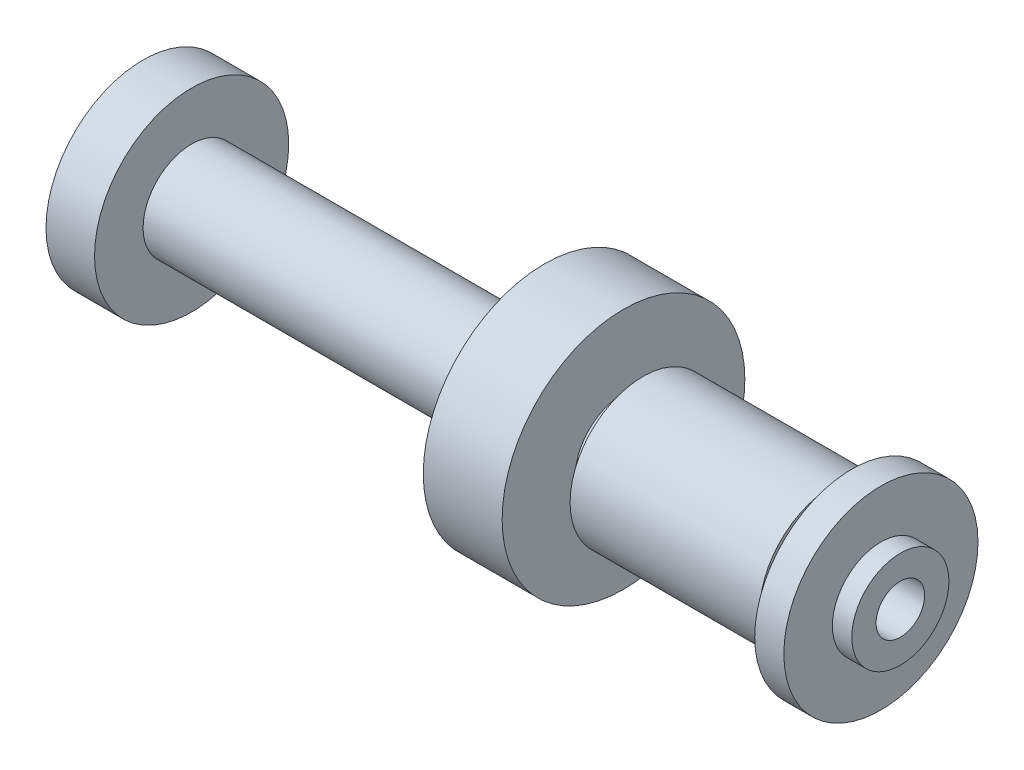
ISO-10303-21;
HEADER;
FILE_DESCRIPTION(('STEP AP214'),'2;1');
FILE_NAME('part.step','',(''),(''),'','','');
FILE_SCHEMA(('AUTOMOTIVE_DESIGN { 1 0 10303 214 1 1 1 1 }'));
ENDSEC;
DATA;
#1=APPLICATION_CONTEXT('core data for automotive mechanical design processes');
#2=APPLICATION_PROTOCOL_DEFINITION('international standard','automotive_design',2000,#1);
#3=PRODUCT_CONTEXT('',#1,'mechanical');
#4=PRODUCT('Part','Part','',(#3));
#5=PRODUCT_RELATED_PRODUCT_CATEGORY('part','',(#4));
#6=PRODUCT_DEFINITION_FORMATION('','',#4);
#7=PRODUCT_DEFINITION_CONTEXT('part definition',#1,'design');
#8=PRODUCT_DEFINITION('design','',#6,#7);
#9=PRODUCT_DEFINITION_SHAPE('','',#8);
#10=(LENGTH_UNIT() NAMED_UNIT(*) SI_UNIT(.MILLI.,.METRE.));
#11=(NAMED_UNIT(*) PLANE_ANGLE_UNIT() SI_UNIT($,.RADIAN.));
#12=(NAMED_UNIT(*) SI_UNIT($,.STERADIAN.) SOLID_ANGLE_UNIT());
#13=UNCERTAINTY_MEASURE_WITH_UNIT(LENGTH_MEASURE(1.E-05),#10,'distance_accuracy_value','');
#14=(GEOMETRIC_REPRESENTATION_CONTEXT(3) GLOBAL_UNCERTAINTY_ASSIGNED_CONTEXT((#13)) GLOBAL_UNIT_ASSIGNED_CONTEXT((#10,
#11,#12)) REPRESENTATION_CONTEXT('',''));
#15=CARTESIAN_POINT('',(0.,0.,0.));
#16=DIRECTION('',(0.,0.,1.));
#17=DIRECTION('',(1.,0.,0.));
#18=AXIS2_PLACEMENT_3D('',#15,#16,#17);
#19=CARTESIAN_POINT('',(0.,0.,0.));
#20=DIRECTION('',(-1.,0.,0.));
#21=DIRECTION('',(0.,0.,1.));
#22=AXIS2_PLACEMENT_3D('',#19,#20,#21);
#23=PLANE('',#22);
#24=CARTESIAN_POINT('',(0.,0.,0.));
#25=DIRECTION('',(1.,0.,0.));
#26=DIRECTION('',(0.,0.,-1.));
#27=AXIS2_PLACEMENT_3D('',#24,#25,#26);
#28=CIRCLE('',#27,3.175);
#29=CARTESIAN_POINT('',(0.,0.,-3.17500000000001));
#30=VERTEX_POINT('',#29);
#31=EDGE_CURVE('E122',#30,#30,#28,.T.);
#32=ORIENTED_EDGE('',*,*,#31,.F.);
#33=EDGE_LOOP('',(#32));
#34=FACE_BOUND('',#33,.T.);
#35=CARTESIAN_POINT('',(0.,0.,0.));
#36=DIRECTION('',(-1.,0.,0.));
#37=DIRECTION('',(0.,0.,1.));
#38=AXIS2_PLACEMENT_3D('',#35,#36,#37);
#39=CIRCLE('',#38,6.35);
#40=CARTESIAN_POINT('',(0.,0.,6.35000000000003));
#41=VERTEX_POINT('',#40);
#42=EDGE_CURVE('E10',#41,#41,#39,.T.);
#43=ORIENTED_EDGE('',*,*,#42,.F.);
#44=EDGE_LOOP('',(#43));
#45=FACE_BOUND('',#44,.T.);
#46=ADVANCED_FACE('F40',(#34,#45),#23,.F.);
#47=CARTESIAN_POINT('',(0.,0.,0.));
#48=DIRECTION('',(-1.,0.,0.));
#49=DIRECTION('',(0.,0.,1.));
#50=AXIS2_PLACEMENT_3D('',#47,#48,#49);
#51=CYLINDRICAL_SURFACE('',#50,6.35);
#52=CARTESIAN_POINT('',(-2.53999999999999,0.,0.));
#53=DIRECTION('',(-1.,0.,0.));
#54=DIRECTION('',(0.,0.,1.));
#55=AXIS2_PLACEMENT_3D('',#52,#53,#54);
#56=CIRCLE('',#55,6.35);
#57=CARTESIAN_POINT('',(-2.53999999999999,0.,6.35000000000003));
#58=VERTEX_POINT('',#57);
#59=EDGE_CURVE('E47',#58,#58,#56,.T.);
#60=ORIENTED_EDGE('',*,*,#59,.F.);
#61=EDGE_LOOP('',(#60));
#62=FACE_BOUND('',#61,.T.);
#63=ORIENTED_EDGE('',*,*,#42,.T.);
#64=EDGE_LOOP('',(#63));
#65=FACE_BOUND('',#64,.T.);
#66=ADVANCED_FACE('F142',(#62,#65),#51,.T.);
#67=CARTESIAN_POINT('',(-2.53999999999999,6.35000000000008,0.));
#68=DIRECTION('',(-1.,0.,0.));
#69=DIRECTION('',(0.,0.,1.));
#70=AXIS2_PLACEMENT_3D('',#67,#68,#69);
#71=PLANE('',#70);
#72=CARTESIAN_POINT('',(-2.53999999999999,0.,0.));
#73=DIRECTION('',(-1.,0.,0.));
#74=DIRECTION('',(0.,0.,1.));
#75=AXIS2_PLACEMENT_3D('',#72,#73,#74);
#76=CIRCLE('',#75,12.7);
#77=CARTESIAN_POINT('',(-2.53999999999999,0.,12.7000000000001));
#78=VERTEX_POINT('',#77);
#79=EDGE_CURVE('E53',#78,#78,#76,.T.);
#80=ORIENTED_EDGE('',*,*,#79,.F.);
#81=EDGE_LOOP('',(#80));
#82=FACE_BOUND('',#81,.T.);
#83=ORIENTED_EDGE('',*,*,#59,.T.);
#84=EDGE_LOOP('',(#83));
#85=FACE_BOUND('',#84,.T.);
#86=ADVANCED_FACE('F146',(#82,#85),#71,.F.);
#87=CARTESIAN_POINT('',(0.,0.,0.));
#88=DIRECTION('',(-1.,0.,0.));
#89=DIRECTION('',(0.,0.,1.));
#90=AXIS2_PLACEMENT_3D('',#87,#88,#89);
#91=CYLINDRICAL_SURFACE('',#90,12.7);
#92=CARTESIAN_POINT('',(-6.34999999999997,0.,0.));
#93=DIRECTION('',(-1.,0.,0.));
#94=DIRECTION('',(0.,0.,1.));
#95=AXIS2_PLACEMENT_3D('',#92,#93,#94);
#96=CIRCLE('',#95,12.7);
#97=CARTESIAN_POINT('',(-6.34999999999997,0.,12.7000000000001));
#98=VERTEX_POINT('',#97);
#99=EDGE_CURVE('E59',#98,#98,#96,.T.);
#100=ORIENTED_EDGE('',*,*,#99,.F.);
#101=EDGE_LOOP('',(#100));
#102=FACE_BOUND('',#101,.T.);
#103=ORIENTED_EDGE('',*,*,#79,.T.);
#104=EDGE_LOOP('',(#103));
#105=FACE_BOUND('',#104,.T.);
#106=ADVANCED_FACE('F151',(#102,#105),#91,.T.);
#107=CARTESIAN_POINT('',(-6.34999999999997,12.7000000000002,-5.41233724504764E-13));
#108=DIRECTION('',(1.,0.,0.));
#109=DIRECTION('',(0.,0.,-1.));
#110=AXIS2_PLACEMENT_3D('',#107,#108,#109);
#111=PLANE('',#110);
#112=CARTESIAN_POINT('',(-6.34999999999997,0.,0.));
#113=DIRECTION('',(-1.,0.,0.));
#114=DIRECTION('',(0.,0.,1.));
#115=AXIS2_PLACEMENT_3D('',#112,#113,#114);
#116=CIRCLE('',#115,6.35);
#117=CARTESIAN_POINT('',(-6.34999999999997,0.,6.35000000000003));
#118=VERTEX_POINT('',#117);
#119=EDGE_CURVE('E65',#118,#118,#116,.T.);
#120=ORIENTED_EDGE('',*,*,#119,.F.);
#121=EDGE_LOOP('',(#120));
#122=FACE_BOUND('',#121,.T.);
#123=ORIENTED_EDGE('',*,*,#99,.T.);
#124=EDGE_LOOP('',(#123));
#125=FACE_BOUND('',#124,.T.);
#126=ADVANCED_FACE('F157',(#122,#125),#111,.F.);
#127=CARTESIAN_POINT('',(0.,0.,0.));
#128=DIRECTION('',(-1.,0.,0.));
#129=DIRECTION('',(0.,0.,1.));
#130=AXIS2_PLACEMENT_3D('',#127,#128,#129);
#131=CYLINDRICAL_SURFACE('',#130,6.35);
#132=CARTESIAN_POINT('',(-8.88999999999995,0.,0.));
#133=DIRECTION('',(-1.,0.,0.));
#134=DIRECTION('',(0.,0.,1.));
#135=AXIS2_PLACEMENT_3D('',#132,#133,#134);
#136=CIRCLE('',#135,6.35);
#137=CARTESIAN_POINT('',(-8.88999999999995,0.,6.35000000000003));
#138=VERTEX_POINT('',#137);
#139=EDGE_CURVE('E69',#138,#138,#136,.T.);
#140=ORIENTED_EDGE('',*,*,#139,.F.);
#141=EDGE_LOOP('',(#140));
#142=FACE_BOUND('',#141,.T.);
#143=ORIENTED_EDGE('',*,*,#119,.T.);
#144=EDGE_LOOP('',(#143));
#145=FACE_BOUND('',#144,.T.);
#146=ADVANCED_FACE('F161',(#142,#145),#131,.T.);
#147=CARTESIAN_POINT('',(-8.88999999999995,6.35000000000008,0.));
#148=DIRECTION('',(-1.,0.,0.));
#149=DIRECTION('',(0.,0.,1.));
#150=AXIS2_PLACEMENT_3D('',#147,#148,#149);
#151=PLANE('',#150);
#152=CARTESIAN_POINT('',(-8.88999999999995,0.,0.));
#153=DIRECTION('',(-1.,0.,0.));
#154=DIRECTION('',(0.,0.,1.));
#155=AXIS2_PLACEMENT_3D('',#152,#153,#154);
#156=CIRCLE('',#155,9.525);
#157=CARTESIAN_POINT('',(-8.88999999999995,0.,9.52500000000004));
#158=VERTEX_POINT('',#157);
#159=EDGE_CURVE('E73',#158,#158,#156,.T.);
#160=ORIENTED_EDGE('',*,*,#159,.F.);
#161=EDGE_LOOP('',(#160));
#162=FACE_BOUND('',#161,.T.);
#163=ORIENTED_EDGE('',*,*,#139,.T.);
#164=EDGE_LOOP('',(#163));
#165=FACE_BOUND('',#164,.T.);
#166=ADVANCED_FACE('F165',(#162,#165),#151,.F.);
#167=CARTESIAN_POINT('',(0.,0.,0.));
#168=DIRECTION('',(-1.,0.,0.));
#169=DIRECTION('',(0.,0.,1.));
#170=AXIS2_PLACEMENT_3D('',#167,#168,#169);
#171=CYLINDRICAL_SURFACE('',#170,9.525);
#172=CARTESIAN_POINT('',(-33.6748863898266,0.,0.));
#173=DIRECTION('',(-1.,0.,0.));
#174=DIRECTION('',(0.,0.,1.));
#175=AXIS2_PLACEMENT_3D('',#172,#173,#174);
#176=CIRCLE('',#175,9.525);
#177=CARTESIAN_POINT('',(-33.6748863898266,0.,9.52500000000005));
#178=VERTEX_POINT('',#177);
#179=EDGE_CURVE('E77',#178,#178,#176,.T.);
#180=ORIENTED_EDGE('',*,*,#179,.F.);
#181=EDGE_LOOP('',(#180));
#182=FACE_BOUND('',#181,.T.);
#183=ORIENTED_EDGE('',*,*,#159,.T.);
#184=EDGE_LOOP('',(#183));
#185=FACE_BOUND('',#184,.T.);
#186=ADVANCED_FACE('F169',(#182,#185),#171,.T.);
#187=CARTESIAN_POINT('',(-33.6748863898266,9.52500000000012,-3.2612801348364E-13));
#188=DIRECTION('',(1.,0.,0.));
#189=DIRECTION('',(0.,0.,-1.));
#190=AXIS2_PLACEMENT_3D('',#187,#188,#189);
#191=PLANE('',#190);
#192=CARTESIAN_POINT('',(-33.6748863898266,0.,0.));
#193=DIRECTION('',(-1.,0.,0.));
#194=DIRECTION('',(0.,0.,1.));
#195=AXIS2_PLACEMENT_3D('',#192,#193,#194);
#196=CIRCLE('',#195,6.35);
#197=CARTESIAN_POINT('',(-33.6748863898266,0.,6.35000000000003));
#198=VERTEX_POINT('',#197);
#199=EDGE_CURVE('E81',#198,#198,#196,.T.);
#200=ORIENTED_EDGE('',*,*,#199,.F.);
#201=EDGE_LOOP('',(#200));
#202=FACE_BOUND('',#201,.T.);
#203=ORIENTED_EDGE('',*,*,#179,.T.);
#204=EDGE_LOOP('',(#203));
#205=FACE_BOUND('',#204,.T.);
#206=ADVANCED_FACE('F173',(#202,#205),#191,.F.);
#207=CARTESIAN_POINT('',(0.,0.,0.));
#208=DIRECTION('',(-1.,0.,0.));
#209=DIRECTION('',(0.,0.,1.));
#210=AXIS2_PLACEMENT_3D('',#207,#208,#209);
#211=CYLINDRICAL_SURFACE('',#210,6.35);
#212=CARTESIAN_POINT('',(-36.2148863898267,0.,0.));
#213=DIRECTION('',(-1.,0.,0.));
#214=DIRECTION('',(0.,0.,1.));
#215=AXIS2_PLACEMENT_3D('',#212,#213,#214);
#216=CIRCLE('',#215,6.35);
#217=CARTESIAN_POINT('',(-36.2148863898267,0.,6.35000000000003));
#218=VERTEX_POINT('',#217);
#219=EDGE_CURVE('E85',#218,#218,#216,.T.);
#220=ORIENTED_EDGE('',*,*,#219,.F.);
#221=EDGE_LOOP('',(#220));
#222=FACE_BOUND('',#221,.T.);
#223=ORIENTED_EDGE('',*,*,#199,.T.);
#224=EDGE_LOOP('',(#223));
#225=FACE_BOUND('',#224,.T.);
#226=ADVANCED_FACE('F177',(#222,#225),#211,.T.);
#227=CARTESIAN_POINT('',(-36.2148863898267,6.35000000000008,0.));
#228=DIRECTION('',(-1.,0.,0.));
#229=DIRECTION('',(0.,0.,1.));
#230=AXIS2_PLACEMENT_3D('',#227,#228,#229);
#231=PLANE('',#230);
#232=CARTESIAN_POINT('',(-36.2148863898267,0.,0.));
#233=DIRECTION('',(-1.,0.,0.));
#234=DIRECTION('',(0.,0.,1.));
#235=AXIS2_PLACEMENT_3D('',#232,#233,#234);
#236=CIRCLE('',#235,15.875);
#237=CARTESIAN_POINT('',(-36.2148863898267,0.,15.8750000000001));
#238=VERTEX_POINT('',#237);
#239=EDGE_CURVE('E89',#238,#238,#236,.T.);
#240=ORIENTED_EDGE('',*,*,#239,.F.);
#241=EDGE_LOOP('',(#240));
#242=FACE_BOUND('',#241,.T.);
#243=ORIENTED_EDGE('',*,*,#219,.T.);
#244=EDGE_LOOP('',(#243));
#245=FACE_BOUND('',#244,.T.);
#246=ADVANCED_FACE('F181',(#242,#245),#231,.F.);
#247=CARTESIAN_POINT('',(0.,0.,0.));
#248=DIRECTION('',(-1.,0.,0.));
#249=DIRECTION('',(0.,0.,1.));
#250=AXIS2_PLACEMENT_3D('',#247,#248,#249);
#251=CYLINDRICAL_SURFACE('',#250,15.875);
#252=CARTESIAN_POINT('',(-46.5313784466667,0.,0.));
#253=DIRECTION('',(-1.,0.,0.));
#254=DIRECTION('',(0.,0.,1.));
#255=AXIS2_PLACEMENT_3D('',#252,#253,#254);
#256=CIRCLE('',#255,15.875);
#257=CARTESIAN_POINT('',(-46.5313784466667,0.,15.8750000000001));
#258=VERTEX_POINT('',#257);
#259=EDGE_CURVE('E93',#258,#258,#256,.T.);
#260=ORIENTED_EDGE('',*,*,#259,.F.);
#261=EDGE_LOOP('',(#260));
#262=FACE_BOUND('',#261,.T.);
#263=ORIENTED_EDGE('',*,*,#239,.T.);
#264=EDGE_LOOP('',(#263));
#265=FACE_BOUND('',#264,.T.);
#266=ADVANCED_FACE('F185',(#262,#265),#251,.T.);
#267=CARTESIAN_POINT('',(-46.5313784466667,15.8750000000002,-3.33066907387547E-13));
#268=DIRECTION('',(1.,0.,0.));
#269=DIRECTION('',(0.,0.,-1.));
#270=AXIS2_PLACEMENT_3D('',#267,#268,#269);
#271=PLANE('',#270);
#272=CARTESIAN_POINT('',(-46.5313784466667,0.,0.));
#273=DIRECTION('',(-1.,0.,0.));
#274=DIRECTION('',(0.,0.,1.));
#275=AXIS2_PLACEMENT_3D('',#272,#273,#274);
#276=CIRCLE('',#275,6.34999999999999);
#277=CARTESIAN_POINT('',(-46.5313784466667,0.,6.35000000000002));
#278=VERTEX_POINT('',#277);
#279=EDGE_CURVE('E97',#278,#278,#276,.T.);
#280=ORIENTED_EDGE('',*,*,#279,.F.);
#281=EDGE_LOOP('',(#280));
#282=FACE_BOUND('',#281,.T.);
#283=ORIENTED_EDGE('',*,*,#259,.T.);
#284=EDGE_LOOP('',(#283));
#285=FACE_BOUND('',#284,.T.);
#286=ADVANCED_FACE('F189',(#282,#285),#271,.F.);
#287=CARTESIAN_POINT('',(0.,0.,0.));
#288=DIRECTION('',(-1.,0.,0.));
#289=DIRECTION('',(0.,0.,1.));
#290=AXIS2_PLACEMENT_3D('',#287,#288,#289);
#291=CYLINDRICAL_SURFACE('',#290,6.34999999999999);
#292=CARTESIAN_POINT('',(-92.71,0.,0.));
#293=DIRECTION('',(-1.,0.,0.));
#294=DIRECTION('',(0.,0.,1.));
#295=AXIS2_PLACEMENT_3D('',#292,#293,#294);
#296=CIRCLE('',#295,6.34999999999999);
#297=CARTESIAN_POINT('',(-92.71,0.,6.35000000000002));
#298=VERTEX_POINT('',#297);
#299=EDGE_CURVE('E101',#298,#298,#296,.T.);
#300=ORIENTED_EDGE('',*,*,#299,.F.);
#301=EDGE_LOOP('',(#300));
#302=FACE_BOUND('',#301,.T.);
#303=ORIENTED_EDGE('',*,*,#279,.T.);
#304=EDGE_LOOP('',(#303));
#305=FACE_BOUND('',#304,.T.);
#306=ADVANCED_FACE('F193',(#302,#305),#291,.T.);
#307=CARTESIAN_POINT('',(-92.71,6.35000000000008,0.));
#308=DIRECTION('',(-1.,0.,0.));
#309=DIRECTION('',(0.,0.,1.));
#310=AXIS2_PLACEMENT_3D('',#307,#308,#309);
#311=PLANE('',#310);
#312=CARTESIAN_POINT('',(-92.71,0.,0.));
#313=DIRECTION('',(-1.,0.,0.));
#314=DIRECTION('',(0.,0.,1.));
#315=AXIS2_PLACEMENT_3D('',#312,#313,#314);
#316=CIRCLE('',#315,12.7);
#317=CARTESIAN_POINT('',(-92.71,0.,12.7));
#318=VERTEX_POINT('',#317);
#319=EDGE_CURVE('E105',#318,#318,#316,.T.);
#320=ORIENTED_EDGE('',*,*,#319,.F.);
#321=EDGE_LOOP('',(#320));
#322=FACE_BOUND('',#321,.T.);
#323=ORIENTED_EDGE('',*,*,#299,.T.);
#324=EDGE_LOOP('',(#323));
#325=FACE_BOUND('',#324,.T.);
#326=ADVANCED_FACE('F197',(#322,#325),#311,.F.);
#327=CARTESIAN_POINT('',(0.,0.,0.));
#328=DIRECTION('',(-1.,0.,0.));
#329=DIRECTION('',(0.,0.,1.));
#330=AXIS2_PLACEMENT_3D('',#327,#328,#329);
#331=CYLINDRICAL_SURFACE('',#330,12.7);
#332=CARTESIAN_POINT('',(-99.06,0.,0.));
#333=DIRECTION('',(-1.,0.,0.));
#334=DIRECTION('',(0.,0.,1.));
#335=AXIS2_PLACEMENT_3D('',#332,#333,#334);
#336=CIRCLE('',#335,12.7);
#337=CARTESIAN_POINT('',(-99.06,0.,12.7));
#338=VERTEX_POINT('',#337);
#339=EDGE_CURVE('E109',#338,#338,#336,.T.);
#340=ORIENTED_EDGE('',*,*,#339,.F.);
#341=EDGE_LOOP('',(#340));
#342=FACE_BOUND('',#341,.T.);
#343=ORIENTED_EDGE('',*,*,#319,.T.);
#344=EDGE_LOOP('',(#343));
#345=FACE_BOUND('',#344,.T.);
#346=ADVANCED_FACE('F201',(#342,#345),#331,.T.);
#347=CARTESIAN_POINT('',(-99.06,12.7000000000007,-8.88178419700125E-13));
#348=DIRECTION('',(1.,0.,0.));
#349=DIRECTION('',(0.,0.,-1.));
#350=AXIS2_PLACEMENT_3D('',#347,#348,#349);
#351=PLANE('',#350);
#352=CARTESIAN_POINT('',(-99.06,0.,0.));
#353=DIRECTION('',(-1.,0.,0.));
#354=DIRECTION('',(0.,0.,1.));
#355=AXIS2_PLACEMENT_3D('',#352,#353,#354);
#356=CIRCLE('',#355,6.35);
#357=CARTESIAN_POINT('',(-99.06,0.,6.35000000000003));
#358=VERTEX_POINT('',#357);
#359=EDGE_CURVE('E113',#358,#358,#356,.T.);
#360=ORIENTED_EDGE('',*,*,#359,.F.);
#361=EDGE_LOOP('',(#360));
#362=FACE_BOUND('',#361,.T.);
#363=ORIENTED_EDGE('',*,*,#339,.T.);
#364=EDGE_LOOP('',(#363));
#365=FACE_BOUND('',#364,.T.);
#366=ADVANCED_FACE('F205',(#362,#365),#351,.F.);
#367=CARTESIAN_POINT('',(0.,0.,0.));
#368=DIRECTION('',(-1.,0.,0.));
#369=DIRECTION('',(0.,0.,1.));
#370=AXIS2_PLACEMENT_3D('',#367,#368,#369);
#371=CYLINDRICAL_SURFACE('',#370,6.35);
#372=CARTESIAN_POINT('',(-101.6,0.,0.));
#373=DIRECTION('',(-1.,0.,0.));
#374=DIRECTION('',(0.,0.,1.));
#375=AXIS2_PLACEMENT_3D('',#372,#373,#374);
#376=CIRCLE('',#375,6.35);
#377=CARTESIAN_POINT('',(-101.6,0.,6.35000000000003));
#378=VERTEX_POINT('',#377);
#379=EDGE_CURVE('E117',#378,#378,#376,.T.);
#380=ORIENTED_EDGE('',*,*,#379,.F.);
#381=EDGE_LOOP('',(#380));
#382=FACE_BOUND('',#381,.T.);
#383=ORIENTED_EDGE('',*,*,#359,.T.);
#384=EDGE_LOOP('',(#383));
#385=FACE_BOUND('',#384,.T.);
#386=ADVANCED_FACE('F209',(#382,#385),#371,.T.);
#387=CARTESIAN_POINT('',(-101.6,6.35000000000008,0.));
#388=DIRECTION('',(1.,0.,0.));
#389=DIRECTION('',(0.,0.,-1.));
#390=AXIS2_PLACEMENT_3D('',#387,#388,#389);
#391=PLANE('',#390);
#392=CARTESIAN_POINT('',(-101.6,0.,0.));
#393=DIRECTION('',(1.,0.,0.));
#394=DIRECTION('',(0.,0.,-1.));
#395=AXIS2_PLACEMENT_3D('',#392,#393,#394);
#396=CIRCLE('',#395,3.175);
#397=CARTESIAN_POINT('',(-101.6,0.,-3.17500000000001));
#398=VERTEX_POINT('',#397);
#399=EDGE_CURVE('E121',#398,#398,#396,.T.);
#400=ORIENTED_EDGE('',*,*,#399,.T.);
#401=EDGE_LOOP('',(#400));
#402=FACE_BOUND('',#401,.T.);
#403=ORIENTED_EDGE('',*,*,#379,.T.);
#404=EDGE_LOOP('',(#403));
#405=FACE_BOUND('',#404,.T.);
#406=ADVANCED_FACE('F131',(#402,#405),#391,.F.);
#407=CARTESIAN_POINT('',(-101.6,0.,0.));
#408=DIRECTION('',(1.,0.,0.));
#409=DIRECTION('',(0.,0.,-1.));
#410=AXIS2_PLACEMENT_3D('',#407,#408,#409);
#411=CYLINDRICAL_SURFACE('',#410,3.175);
#412=ORIENTED_EDGE('',*,*,#399,.F.);
#413=EDGE_LOOP('',(#412));
#414=FACE_BOUND('',#413,.T.);
#415=ORIENTED_EDGE('',*,*,#31,.T.);
#416=EDGE_LOOP('',(#415));
#417=FACE_BOUND('',#416,.T.);
#418=ADVANCED_FACE('F134',(#414,#417),#411,.F.);
#419=CLOSED_SHELL('',(#46,#66,#86,#106,#126,#146,#166,#186,#206,#226,#246,#266,#286,#306,#326,
#346,#366,#386,#406,#418));
#420=MANIFOLD_SOLID_BREP('B2',#419);
#421=ADVANCED_BREP_SHAPE_REPRESENTATION('',(#18,#420),#14);
#422=SHAPE_DEFINITION_REPRESENTATION(#9,#421);
ENDSEC;
END-ISO-10303-21;
